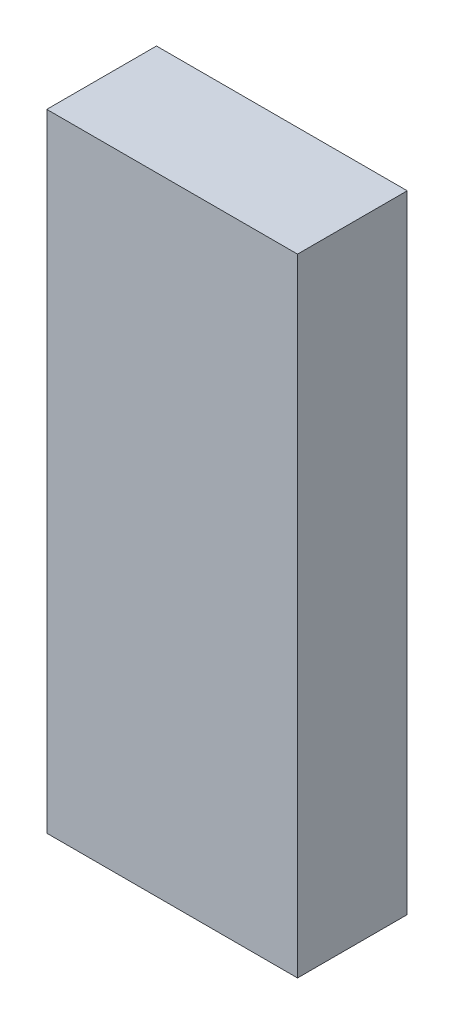
ISO-10303-21;
HEADER;
FILE_DESCRIPTION(('STEP AP214'),'2;1');
FILE_NAME('part.step','',(''),(''),'','','');
FILE_SCHEMA(('AUTOMOTIVE_DESIGN { 1 0 10303 214 1 1 1 1 }'));
ENDSEC;
DATA;
#1=APPLICATION_CONTEXT('core data for automotive mechanical design processes');
#2=APPLICATION_PROTOCOL_DEFINITION('international standard','automotive_design',2000,#1);
#3=PRODUCT_CONTEXT('',#1,'mechanical');
#4=PRODUCT('Part','Part','',(#3));
#5=PRODUCT_RELATED_PRODUCT_CATEGORY('part','',(#4));
#6=PRODUCT_DEFINITION_FORMATION('','',#4);
#7=PRODUCT_DEFINITION_CONTEXT('part definition',#1,'design');
#8=PRODUCT_DEFINITION('design','',#6,#7);
#9=PRODUCT_DEFINITION_SHAPE('','',#8);
#10=(LENGTH_UNIT() NAMED_UNIT(*) SI_UNIT(.MILLI.,.METRE.));
#11=(NAMED_UNIT(*) PLANE_ANGLE_UNIT() SI_UNIT($,.RADIAN.));
#12=(NAMED_UNIT(*) SI_UNIT($,.STERADIAN.) SOLID_ANGLE_UNIT());
#13=UNCERTAINTY_MEASURE_WITH_UNIT(LENGTH_MEASURE(1.E-05),#10,'distance_accuracy_value','');
#14=(GEOMETRIC_REPRESENTATION_CONTEXT(3) GLOBAL_UNCERTAINTY_ASSIGNED_CONTEXT((#13)) GLOBAL_UNIT_ASSIGNED_CONTEXT((#10,
#11,#12)) REPRESENTATION_CONTEXT('',''));
#15=CARTESIAN_POINT('',(0.,0.,0.));
#16=DIRECTION('',(0.,0.,1.));
#17=DIRECTION('',(1.,0.,0.));
#18=AXIS2_PLACEMENT_3D('',#15,#16,#17);
#19=CARTESIAN_POINT('',(0.,0.,0.27999944));
#20=DIRECTION('',(0.,0.,1.));
#21=DIRECTION('',(1.,0.,0.));
#22=AXIS2_PLACEMENT_3D('',#19,#20,#21);
#23=PLANE('',#22);
#24=DIRECTION('',(0.,1.,0.));
#25=VECTOR('',#24,1.);
#26=CARTESIAN_POINT('',(0.31999936,-0.80000094,0.27999944));
#27=LINE('',#26,#25);
#28=CARTESIAN_POINT('',(0.31999936,-0.80000094,0.27999944));
#29=VERTEX_POINT('',#28);
#30=CARTESIAN_POINT('',(0.31999936,0.80000094,0.27999944));
#31=VERTEX_POINT('',#30);
#32=EDGE_CURVE('E83',#29,#31,#27,.T.);
#33=ORIENTED_EDGE('',*,*,#32,.T.);
#34=DIRECTION('',(-1.,0.,0.));
#35=VECTOR('',#34,1.);
#36=CARTESIAN_POINT('',(0.31999936,0.80000094,0.27999944));
#37=LINE('',#36,#35);
#38=CARTESIAN_POINT('',(-0.31999936,0.80000094,0.27999944));
#39=VERTEX_POINT('',#38);
#40=EDGE_CURVE('E72',#31,#39,#37,.T.);
#41=ORIENTED_EDGE('',*,*,#40,.T.);
#42=DIRECTION('',(0.,-1.,0.));
#43=VECTOR('',#42,1.);
#44=CARTESIAN_POINT('',(-0.31999936,0.80000094,0.27999944));
#45=LINE('',#44,#43);
#46=CARTESIAN_POINT('',(-0.31999936,-0.80000094,0.27999944));
#47=VERTEX_POINT('',#46);
#48=EDGE_CURVE('E105',#39,#47,#45,.T.);
#49=ORIENTED_EDGE('',*,*,#48,.T.);
#50=DIRECTION('',(1.,0.,0.));
#51=VECTOR('',#50,1.);
#52=CARTESIAN_POINT('',(-0.31999936,-0.80000094,0.27999944));
#53=LINE('',#52,#51);
#54=EDGE_CURVE('E11',#47,#29,#53,.T.);
#55=ORIENTED_EDGE('',*,*,#54,.T.);
#56=EDGE_LOOP('',(#33,#41,#49,#55));
#57=FACE_BOUND('',#56,.T.);
#58=ADVANCED_FACE('F16',(#57),#23,.T.);
#59=CARTESIAN_POINT('',(0.,0.,0.));
#60=DIRECTION('',(0.,0.,1.));
#61=DIRECTION('',(1.,0.,0.));
#62=AXIS2_PLACEMENT_3D('',#59,#60,#61);
#63=PLANE('',#62);
#64=DIRECTION('',(0.,1.,0.));
#65=VECTOR('',#64,1.);
#66=CARTESIAN_POINT('',(0.31999936,-0.80000094,0.));
#67=LINE('',#66,#65);
#68=CARTESIAN_POINT('',(0.31999936,-0.80000094,0.));
#69=VERTEX_POINT('',#68);
#70=CARTESIAN_POINT('',(0.31999936,0.80000094,0.));
#71=VERTEX_POINT('',#70);
#72=EDGE_CURVE('E90',#69,#71,#67,.T.);
#73=ORIENTED_EDGE('',*,*,#72,.F.);
#74=DIRECTION('',(1.,0.,0.));
#75=VECTOR('',#74,1.);
#76=CARTESIAN_POINT('',(-0.31999936,-0.80000094,0.));
#77=LINE('',#76,#75);
#78=CARTESIAN_POINT('',(-0.31999936,-0.80000094,0.));
#79=VERTEX_POINT('',#78);
#80=EDGE_CURVE('E27',#79,#69,#77,.T.);
#81=ORIENTED_EDGE('',*,*,#80,.F.);
#82=DIRECTION('',(0.,-1.,0.));
#83=VECTOR('',#82,1.);
#84=CARTESIAN_POINT('',(-0.31999936,0.80000094,0.));
#85=LINE('',#84,#83);
#86=CARTESIAN_POINT('',(-0.31999936,0.80000094,0.));
#87=VERTEX_POINT('',#86);
#88=EDGE_CURVE('E62',#87,#79,#85,.T.);
#89=ORIENTED_EDGE('',*,*,#88,.F.);
#90=DIRECTION('',(-1.,0.,0.));
#91=VECTOR('',#90,1.);
#92=CARTESIAN_POINT('',(0.31999936,0.80000094,0.));
#93=LINE('',#92,#91);
#94=EDGE_CURVE('E20',#71,#87,#93,.T.);
#95=ORIENTED_EDGE('',*,*,#94,.F.);
#96=EDGE_LOOP('',(#73,#81,#89,#95));
#97=FACE_BOUND('',#96,.T.);
#98=ADVANCED_FACE('F118',(#97),#63,.F.);
#99=CARTESIAN_POINT('',(-0.31999936,-0.80000094,0.));
#100=DIRECTION('',(0.,1.,0.));
#101=DIRECTION('',(1.,0.,0.));
#102=AXIS2_PLACEMENT_3D('',#99,#100,#101);
#103=PLANE('',#102);
#104=DIRECTION('',(0.,0.,1.));
#105=VECTOR('',#104,1.);
#106=CARTESIAN_POINT('',(-0.31999936,-0.80000094,0.));
#107=LINE('',#106,#105);
#108=EDGE_CURVE('E101',#79,#47,#107,.T.);
#109=ORIENTED_EDGE('',*,*,#108,.F.);
#110=ORIENTED_EDGE('',*,*,#80,.T.);
#111=DIRECTION('',(0.,0.,1.));
#112=VECTOR('',#111,1.);
#113=CARTESIAN_POINT('',(0.31999936,-0.80000094,0.));
#114=LINE('',#113,#112);
#115=EDGE_CURVE('E97',#69,#29,#114,.T.);
#116=ORIENTED_EDGE('',*,*,#115,.T.);
#117=ORIENTED_EDGE('',*,*,#54,.F.);
#118=EDGE_LOOP('',(#109,#110,#116,#117));
#119=FACE_BOUND('',#118,.T.);
#120=ADVANCED_FACE('F117',(#119),#103,.F.);
#121=CARTESIAN_POINT('',(-0.31999936,0.80000094,0.));
#122=DIRECTION('',(1.,0.,0.));
#123=DIRECTION('',(0.,1.,0.));
#124=AXIS2_PLACEMENT_3D('',#121,#122,#123);
#125=PLANE('',#124);
#126=DIRECTION('',(0.,0.,1.));
#127=VECTOR('',#126,1.);
#128=CARTESIAN_POINT('',(-0.31999936,0.80000094,0.));
#129=LINE('',#128,#127);
#130=EDGE_CURVE('E78',#87,#39,#129,.T.);
#131=ORIENTED_EDGE('',*,*,#130,.F.);
#132=ORIENTED_EDGE('',*,*,#88,.T.);
#133=ORIENTED_EDGE('',*,*,#108,.T.);
#134=ORIENTED_EDGE('',*,*,#48,.F.);
#135=EDGE_LOOP('',(#131,#132,#133,#134));
#136=FACE_BOUND('',#135,.T.);
#137=ADVANCED_FACE('F116',(#136),#125,.F.);
#138=CARTESIAN_POINT('',(0.31999936,0.80000094,0.));
#139=DIRECTION('',(0.,-1.,0.));
#140=DIRECTION('',(0.,0.,-1.));
#141=AXIS2_PLACEMENT_3D('',#138,#139,#140);
#142=PLANE('',#141);
#143=DIRECTION('',(0.,0.,1.));
#144=VECTOR('',#143,1.);
#145=CARTESIAN_POINT('',(0.31999936,0.80000094,0.));
#146=LINE('',#145,#144);
#147=EDGE_CURVE('E76',#71,#31,#146,.T.);
#148=ORIENTED_EDGE('',*,*,#147,.F.);
#149=ORIENTED_EDGE('',*,*,#94,.T.);
#150=ORIENTED_EDGE('',*,*,#130,.T.);
#151=ORIENTED_EDGE('',*,*,#40,.F.);
#152=EDGE_LOOP('',(#148,#149,#150,#151));
#153=FACE_BOUND('',#152,.T.);
#154=ADVANCED_FACE('F18',(#153),#142,.F.);
#155=CARTESIAN_POINT('',(0.31999936,-0.80000094,0.));
#156=DIRECTION('',(-1.,0.,0.));
#157=DIRECTION('',(0.,0.,1.));
#158=AXIS2_PLACEMENT_3D('',#155,#156,#157);
#159=PLANE('',#158);
#160=ORIENTED_EDGE('',*,*,#115,.F.);
#161=ORIENTED_EDGE('',*,*,#72,.T.);
#162=ORIENTED_EDGE('',*,*,#147,.T.);
#163=ORIENTED_EDGE('',*,*,#32,.F.);
#164=EDGE_LOOP('',(#160,#161,#162,#163));
#165=FACE_BOUND('',#164,.T.);
#166=ADVANCED_FACE('F88',(#165),#159,.F.);
#167=CLOSED_SHELL('',(#58,#98,#120,#137,#154,#166));
#168=MANIFOLD_SOLID_BREP('B1',#167);
#169=ADVANCED_BREP_SHAPE_REPRESENTATION('',(#18,#168),#14);
#170=SHAPE_DEFINITION_REPRESENTATION(#9,#169);
ENDSEC;
END-ISO-10303-21;
